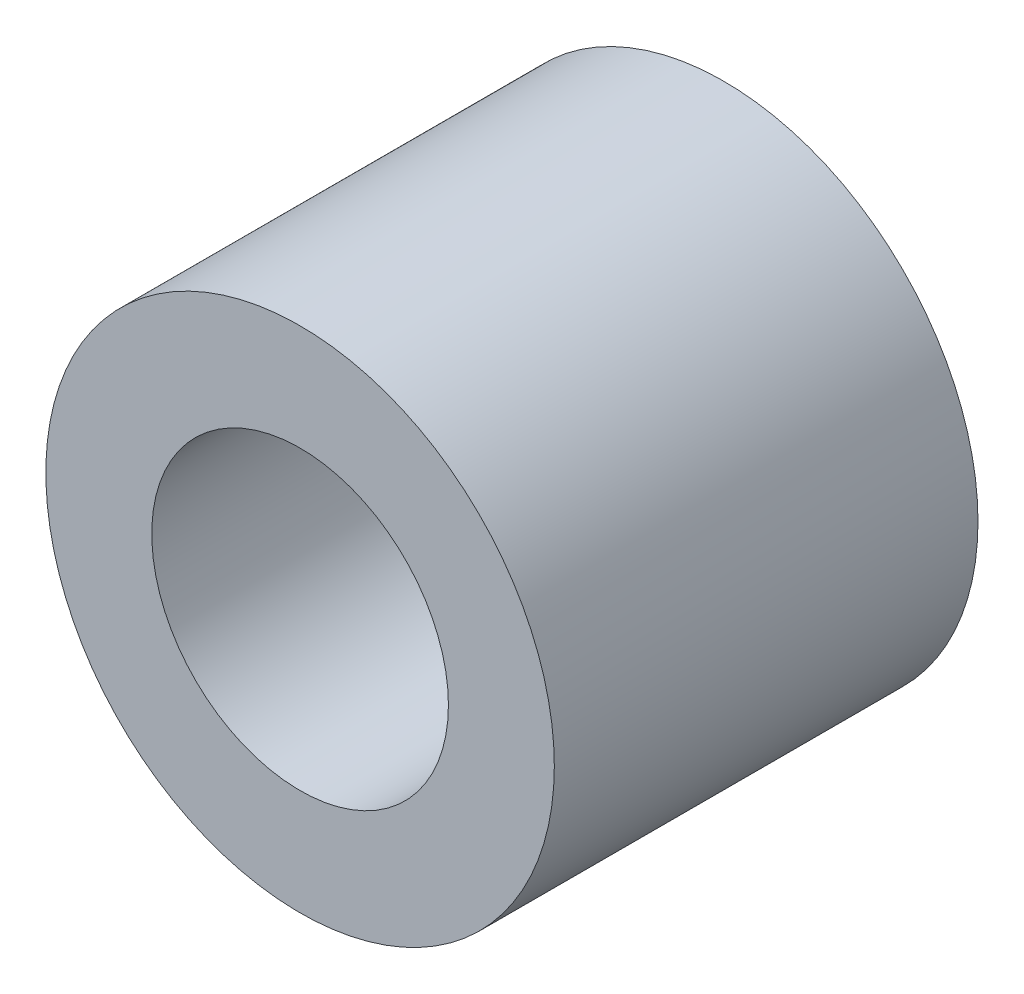
ISO-10303-21;
HEADER;
FILE_DESCRIPTION(('STEP AP214'),'2;1');
FILE_NAME('part.step','',(''),(''),'','','');
FILE_SCHEMA(('AUTOMOTIVE_DESIGN { 1 0 10303 214 1 1 1 1 }'));
ENDSEC;
DATA;
#1=APPLICATION_CONTEXT('core data for automotive mechanical design processes');
#2=APPLICATION_PROTOCOL_DEFINITION('international standard','automotive_design',2000,#1);
#3=PRODUCT_CONTEXT('',#1,'mechanical');
#4=PRODUCT('Part','Part','',(#3));
#5=PRODUCT_RELATED_PRODUCT_CATEGORY('part','',(#4));
#6=PRODUCT_DEFINITION_FORMATION('','',#4);
#7=PRODUCT_DEFINITION_CONTEXT('part definition',#1,'design');
#8=PRODUCT_DEFINITION('design','',#6,#7);
#9=PRODUCT_DEFINITION_SHAPE('','',#8);
#10=(LENGTH_UNIT() NAMED_UNIT(*) SI_UNIT(.MILLI.,.METRE.));
#11=(NAMED_UNIT(*) PLANE_ANGLE_UNIT() SI_UNIT($,.RADIAN.));
#12=(NAMED_UNIT(*) SI_UNIT($,.STERADIAN.) SOLID_ANGLE_UNIT());
#13=UNCERTAINTY_MEASURE_WITH_UNIT(LENGTH_MEASURE(1.E-05),#10,'distance_accuracy_value','');
#14=(GEOMETRIC_REPRESENTATION_CONTEXT(3) GLOBAL_UNCERTAINTY_ASSIGNED_CONTEXT((#13)) GLOBAL_UNIT_ASSIGNED_CONTEXT((#10,
#11,#12)) REPRESENTATION_CONTEXT('',''));
#15=CARTESIAN_POINT('',(0.,0.,0.));
#16=DIRECTION('',(0.,0.,1.));
#17=DIRECTION('',(1.,0.,0.));
#18=AXIS2_PLACEMENT_3D('',#15,#16,#17);
#19=CARTESIAN_POINT('',(0.,0.,0.));
#20=DIRECTION('',(0.,0.,1.));
#21=DIRECTION('',(1.,0.,0.));
#22=AXIS2_PLACEMENT_3D('',#19,#20,#21);
#23=CYLINDRICAL_SURFACE('',#22,2.78);
#24=CARTESIAN_POINT('',(0.,0.,0.));
#25=DIRECTION('',(0.,0.,1.));
#26=DIRECTION('',(1.,0.,0.));
#27=AXIS2_PLACEMENT_3D('',#24,#25,#26);
#28=CIRCLE('',#27,2.78);
#29=CARTESIAN_POINT('',(2.78,0.,0.));
#30=VERTEX_POINT('',#29);
#31=EDGE_CURVE('E26',#30,#30,#28,.F.);
#32=ORIENTED_EDGE('',*,*,#31,.T.);
#33=EDGE_LOOP('',(#32));
#34=FACE_BOUND('',#33,.T.);
#35=CARTESIAN_POINT('',(0.,0.,7.94));
#36=DIRECTION('',(0.,0.,1.));
#37=DIRECTION('',(1.,0.,0.));
#38=AXIS2_PLACEMENT_3D('',#35,#36,#37);
#39=CIRCLE('',#38,2.78);
#40=CARTESIAN_POINT('',(2.78,0.,7.94));
#41=VERTEX_POINT('',#40);
#42=EDGE_CURVE('E17',#41,#41,#39,.F.);
#43=ORIENTED_EDGE('',*,*,#42,.F.);
#44=EDGE_LOOP('',(#43));
#45=FACE_BOUND('',#44,.T.);
#46=ADVANCED_FACE('F14',(#34,#45),#23,.F.);
#47=CARTESIAN_POINT('',(0.,0.,7.94));
#48=DIRECTION('',(0.,0.,1.));
#49=DIRECTION('',(1.,0.,0.));
#50=AXIS2_PLACEMENT_3D('',#47,#48,#49);
#51=PLANE('',#50);
#52=CARTESIAN_POINT('',(0.,0.,7.94));
#53=DIRECTION('',(0.,0.,1.));
#54=DIRECTION('',(1.,0.,0.));
#55=AXIS2_PLACEMENT_3D('',#52,#53,#54);
#56=CIRCLE('',#55,4.765);
#57=CARTESIAN_POINT('',(4.765,0.,7.94));
#58=VERTEX_POINT('',#57);
#59=EDGE_CURVE('E21',#58,#58,#56,.F.);
#60=ORIENTED_EDGE('',*,*,#59,.F.);
#61=EDGE_LOOP('',(#60));
#62=FACE_BOUND('',#61,.T.);
#63=ORIENTED_EDGE('',*,*,#42,.T.);
#64=EDGE_LOOP('',(#63));
#65=FACE_BOUND('',#64,.T.);
#66=ADVANCED_FACE('F34',(#62,#65),#51,.T.);
#67=CARTESIAN_POINT('',(0.,0.,0.));
#68=DIRECTION('',(0.,0.,1.));
#69=DIRECTION('',(1.,0.,0.));
#70=AXIS2_PLACEMENT_3D('',#67,#68,#69);
#71=PLANE('',#70);
#72=CARTESIAN_POINT('',(0.,0.,0.));
#73=DIRECTION('',(0.,0.,1.));
#74=DIRECTION('',(1.,0.,0.));
#75=AXIS2_PLACEMENT_3D('',#72,#73,#74);
#76=CIRCLE('',#75,4.765);
#77=CARTESIAN_POINT('',(4.765,0.,0.));
#78=VERTEX_POINT('',#77);
#79=EDGE_CURVE('E10',#78,#78,#76,.T.);
#80=ORIENTED_EDGE('',*,*,#79,.F.);
#81=EDGE_LOOP('',(#80));
#82=FACE_BOUND('',#81,.T.);
#83=ORIENTED_EDGE('',*,*,#31,.F.);
#84=EDGE_LOOP('',(#83));
#85=FACE_BOUND('',#84,.T.);
#86=ADVANCED_FACE('F41',(#82,#85),#71,.F.);
#87=CARTESIAN_POINT('',(0.,0.,0.));
#88=DIRECTION('',(0.,0.,1.));
#89=DIRECTION('',(1.,0.,0.));
#90=AXIS2_PLACEMENT_3D('',#87,#88,#89);
#91=CYLINDRICAL_SURFACE('',#90,4.765);
#92=ORIENTED_EDGE('',*,*,#79,.T.);
#93=EDGE_LOOP('',(#92));
#94=FACE_BOUND('',#93,.T.);
#95=ORIENTED_EDGE('',*,*,#59,.T.);
#96=EDGE_LOOP('',(#95));
#97=FACE_BOUND('',#96,.T.);
#98=ADVANCED_FACE('F43',(#94,#97),#91,.T.);
#99=CLOSED_SHELL('',(#46,#66,#86,#98));
#100=MANIFOLD_SOLID_BREP('B1',#99);
#101=ADVANCED_BREP_SHAPE_REPRESENTATION('',(#18,#100),#14);
#102=SHAPE_DEFINITION_REPRESENTATION(#9,#101);
ENDSEC;
END-ISO-10303-21;
